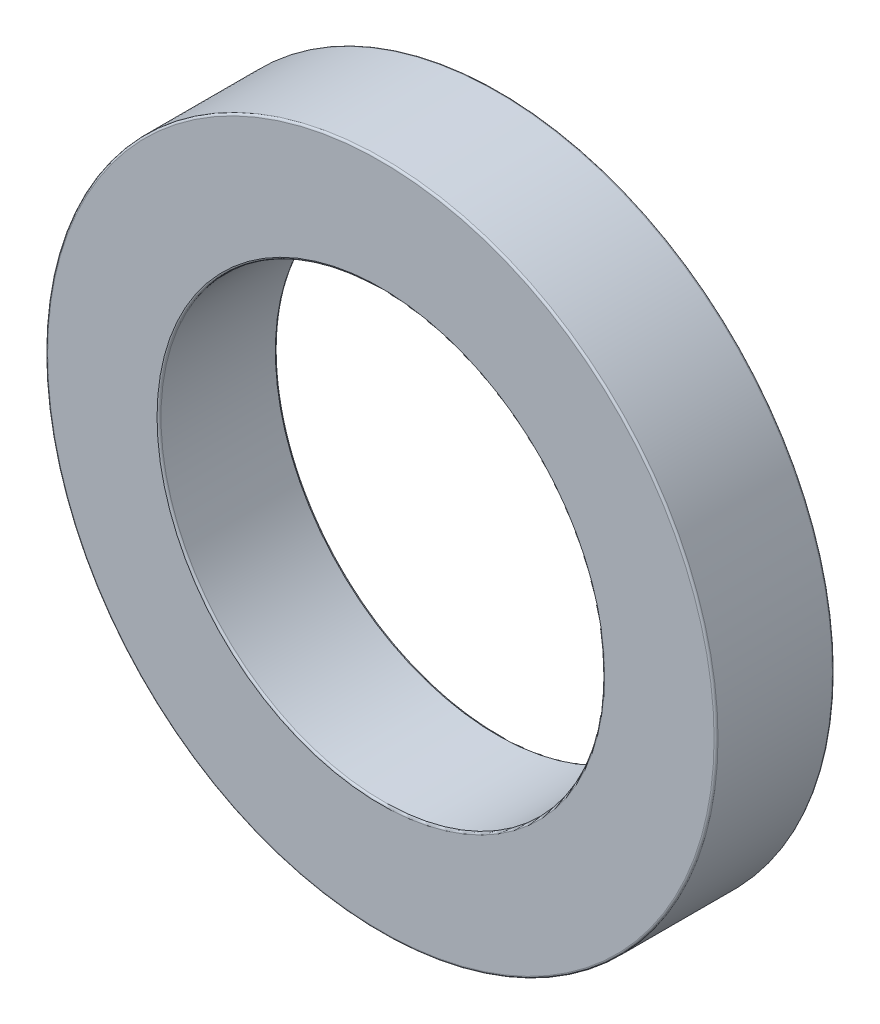
ISO-10303-21;
HEADER;
FILE_DESCRIPTION(('STEP AP214'),'2;1');
FILE_NAME('part.step','',(''),(''),'','','');
FILE_SCHEMA(('AUTOMOTIVE_DESIGN { 1 0 10303 214 1 1 1 1 }'));
ENDSEC;
DATA;
#1=APPLICATION_CONTEXT('core data for automotive mechanical design processes');
#2=APPLICATION_PROTOCOL_DEFINITION('international standard','automotive_design',2000,#1);
#3=PRODUCT_CONTEXT('',#1,'mechanical');
#4=PRODUCT('Part','Part','',(#3));
#5=PRODUCT_RELATED_PRODUCT_CATEGORY('part','',(#4));
#6=PRODUCT_DEFINITION_FORMATION('','',#4);
#7=PRODUCT_DEFINITION_CONTEXT('part definition',#1,'design');
#8=PRODUCT_DEFINITION('design','',#6,#7);
#9=PRODUCT_DEFINITION_SHAPE('','',#8);
#10=(LENGTH_UNIT() NAMED_UNIT(*) SI_UNIT(.MILLI.,.METRE.));
#11=(NAMED_UNIT(*) PLANE_ANGLE_UNIT() SI_UNIT($,.RADIAN.));
#12=(NAMED_UNIT(*) SI_UNIT($,.STERADIAN.) SOLID_ANGLE_UNIT());
#13=UNCERTAINTY_MEASURE_WITH_UNIT(LENGTH_MEASURE(1.E-05),#10,'distance_accuracy_value','');
#14=(GEOMETRIC_REPRESENTATION_CONTEXT(3) GLOBAL_UNCERTAINTY_ASSIGNED_CONTEXT((#13)) GLOBAL_UNIT_ASSIGNED_CONTEXT((#10,
#11,#12)) REPRESENTATION_CONTEXT('',''));
#15=CARTESIAN_POINT('',(0.,0.,0.));
#16=DIRECTION('',(0.,0.,1.));
#17=DIRECTION('',(1.,0.,0.));
#18=AXIS2_PLACEMENT_3D('',#15,#16,#17);
#19=CARTESIAN_POINT('',(0.,0.,12.));
#20=DIRECTION('',(0.,0.,1.));
#21=DIRECTION('',(1.,0.,0.));
#22=AXIS2_PLACEMENT_3D('',#19,#20,#21);
#23=PLANE('',#22);
#24=CARTESIAN_POINT('',(0.,0.,12.));
#25=DIRECTION('',(0.,0.,1.));
#26=DIRECTION('',(1.,0.,0.));
#27=AXIS2_PLACEMENT_3D('',#24,#25,#26);
#28=CIRCLE('',#27,22.7);
#29=CARTESIAN_POINT('',(22.7,0.,12.));
#30=VERTEX_POINT('',#29);
#31=EDGE_CURVE('E47',#30,#30,#28,.F.);
#32=ORIENTED_EDGE('',*,*,#31,.T.);
#33=EDGE_LOOP('',(#32));
#34=FACE_BOUND('',#33,.T.);
#35=CARTESIAN_POINT('',(0.,0.,12.));
#36=DIRECTION('',(0.,0.,1.));
#37=DIRECTION('',(1.,0.,0.));
#38=AXIS2_PLACEMENT_3D('',#35,#36,#37);
#39=CIRCLE('',#38,33.8);
#40=CARTESIAN_POINT('',(33.8,0.,12.));
#41=VERTEX_POINT('',#40);
#42=EDGE_CURVE('E51',#41,#41,#39,.T.);
#43=ORIENTED_EDGE('',*,*,#42,.T.);
#44=EDGE_LOOP('',(#43));
#45=FACE_BOUND('',#44,.T.);
#46=ADVANCED_FACE('F36',(#34,#45),#23,.T.);
#47=CARTESIAN_POINT('',(0.,0.,0.));
#48=DIRECTION('',(0.,0.,1.));
#49=DIRECTION('',(1.,0.,0.));
#50=AXIS2_PLACEMENT_3D('',#47,#48,#49);
#51=PLANE('',#50);
#52=CARTESIAN_POINT('',(0.,0.,0.));
#53=DIRECTION('',(0.,0.,1.));
#54=DIRECTION('',(1.,0.,0.));
#55=AXIS2_PLACEMENT_3D('',#52,#53,#54);
#56=CIRCLE('',#55,22.7);
#57=CARTESIAN_POINT('',(22.7,0.,0.));
#58=VERTEX_POINT('',#57);
#59=EDGE_CURVE('E62',#58,#58,#56,.T.);
#60=ORIENTED_EDGE('',*,*,#59,.T.);
#61=EDGE_LOOP('',(#60));
#62=FACE_BOUND('',#61,.T.);
#63=CARTESIAN_POINT('',(0.,0.,0.));
#64=DIRECTION('',(0.,0.,1.));
#65=DIRECTION('',(1.,0.,0.));
#66=AXIS2_PLACEMENT_3D('',#63,#64,#65);
#67=CIRCLE('',#66,33.8);
#68=CARTESIAN_POINT('',(33.8,0.,0.));
#69=VERTEX_POINT('',#68);
#70=EDGE_CURVE('E65',#69,#69,#67,.F.);
#71=ORIENTED_EDGE('',*,*,#70,.T.);
#72=EDGE_LOOP('',(#71));
#73=FACE_BOUND('',#72,.T.);
#74=ADVANCED_FACE('F69',(#62,#73),#51,.F.);
#75=CARTESIAN_POINT('',(0.,0.,12.));
#76=DIRECTION('',(0.,0.,-1.));
#77=DIRECTION('',(-1.,0.,0.));
#78=AXIS2_PLACEMENT_3D('',#75,#76,#77);
#79=CYLINDRICAL_SURFACE('',#78,34.);
#80=CARTESIAN_POINT('',(0.,0.,0.200000000000001));
#81=DIRECTION('',(0.,0.,1.));
#82=DIRECTION('',(1.,0.,0.));
#83=AXIS2_PLACEMENT_3D('',#80,#81,#82);
#84=CIRCLE('',#83,34.);
#85=CARTESIAN_POINT('',(34.,0.,0.200000000000001));
#86=VERTEX_POINT('',#85);
#87=EDGE_CURVE('E10',#86,#86,#84,.T.);
#88=ORIENTED_EDGE('',*,*,#87,.T.);
#89=EDGE_LOOP('',(#88));
#90=FACE_BOUND('',#89,.T.);
#91=CARTESIAN_POINT('',(0.,0.,11.8));
#92=DIRECTION('',(0.,0.,1.));
#93=DIRECTION('',(1.,0.,0.));
#94=AXIS2_PLACEMENT_3D('',#91,#92,#93);
#95=CIRCLE('',#94,34.);
#96=CARTESIAN_POINT('',(34.,0.,11.8));
#97=VERTEX_POINT('',#96);
#98=EDGE_CURVE('E43',#97,#97,#95,.F.);
#99=ORIENTED_EDGE('',*,*,#98,.T.);
#100=EDGE_LOOP('',(#99));
#101=FACE_BOUND('',#100,.T.);
#102=ADVANCED_FACE('F89',(#90,#101),#79,.T.);
#103=CARTESIAN_POINT('',(0.,0.,12.));
#104=DIRECTION('',(0.,0.,-1.));
#105=DIRECTION('',(-1.,0.,0.));
#106=AXIS2_PLACEMENT_3D('',#103,#104,#105);
#107=CYLINDRICAL_SURFACE('',#106,22.5);
#108=CARTESIAN_POINT('',(0.,0.,0.200000000000001));
#109=DIRECTION('',(0.,0.,1.));
#110=DIRECTION('',(1.,0.,0.));
#111=AXIS2_PLACEMENT_3D('',#108,#109,#110);
#112=CIRCLE('',#111,22.5);
#113=CARTESIAN_POINT('',(22.5,0.,0.200000000000001));
#114=VERTEX_POINT('',#113);
#115=EDGE_CURVE('E56',#114,#114,#112,.F.);
#116=ORIENTED_EDGE('',*,*,#115,.T.);
#117=EDGE_LOOP('',(#116));
#118=FACE_BOUND('',#117,.T.);
#119=CARTESIAN_POINT('',(0.,0.,11.8));
#120=DIRECTION('',(0.,0.,1.));
#121=DIRECTION('',(1.,0.,0.));
#122=AXIS2_PLACEMENT_3D('',#119,#120,#121);
#123=CIRCLE('',#122,22.5);
#124=CARTESIAN_POINT('',(22.5,0.,11.8));
#125=VERTEX_POINT('',#124);
#126=EDGE_CURVE('E59',#125,#125,#123,.T.);
#127=ORIENTED_EDGE('',*,*,#126,.T.);
#128=EDGE_LOOP('',(#127));
#129=FACE_BOUND('',#128,.T.);
#130=ADVANCED_FACE('F94',(#118,#129),#107,.F.);
#131=CARTESIAN_POINT('',(0.,0.,0.200000000000001));
#132=DIRECTION('',(0.,0.,1.));
#133=DIRECTION('',(1.,0.,0.));
#134=AXIS2_PLACEMENT_3D('',#131,#132,#133);
#135=TOROIDAL_SURFACE('',#134,22.7,0.2);
#136=ORIENTED_EDGE('',*,*,#115,.F.);
#137=EDGE_LOOP('',(#136));
#138=FACE_BOUND('',#137,.T.);
#139=ORIENTED_EDGE('',*,*,#59,.F.);
#140=EDGE_LOOP('',(#139));
#141=FACE_BOUND('',#140,.T.);
#142=ADVANCED_FACE('F80',(#138,#141),#135,.T.);
#143=CARTESIAN_POINT('',(0.,0.,11.8));
#144=DIRECTION('',(0.,0.,1.));
#145=DIRECTION('',(1.,0.,0.));
#146=AXIS2_PLACEMENT_3D('',#143,#144,#145);
#147=TOROIDAL_SURFACE('',#146,22.7,0.2);
#148=ORIENTED_EDGE('',*,*,#31,.F.);
#149=EDGE_LOOP('',(#148));
#150=FACE_BOUND('',#149,.T.);
#151=ORIENTED_EDGE('',*,*,#126,.F.);
#152=EDGE_LOOP('',(#151));
#153=FACE_BOUND('',#152,.T.);
#154=ADVANCED_FACE('F74',(#150,#153),#147,.T.);
#155=CARTESIAN_POINT('',(0.,0.,0.200000000000001));
#156=DIRECTION('',(0.,0.,1.));
#157=DIRECTION('',(1.,0.,0.));
#158=AXIS2_PLACEMENT_3D('',#155,#156,#157);
#159=TOROIDAL_SURFACE('',#158,33.8,0.2);
#160=ORIENTED_EDGE('',*,*,#70,.F.);
#161=EDGE_LOOP('',(#160));
#162=FACE_BOUND('',#161,.T.);
#163=ORIENTED_EDGE('',*,*,#87,.F.);
#164=EDGE_LOOP('',(#163));
#165=FACE_BOUND('',#164,.T.);
#166=ADVANCED_FACE('F71',(#162,#165),#159,.T.);
#167=CARTESIAN_POINT('',(0.,0.,11.8));
#168=DIRECTION('',(0.,0.,1.));
#169=DIRECTION('',(1.,0.,0.));
#170=AXIS2_PLACEMENT_3D('',#167,#168,#169);
#171=TOROIDAL_SURFACE('',#170,33.8,0.2);
#172=ORIENTED_EDGE('',*,*,#98,.F.);
#173=EDGE_LOOP('',(#172));
#174=FACE_BOUND('',#173,.T.);
#175=ORIENTED_EDGE('',*,*,#42,.F.);
#176=EDGE_LOOP('',(#175));
#177=FACE_BOUND('',#176,.T.);
#178=ADVANCED_FACE('F38',(#174,#177),#171,.T.);
#179=CLOSED_SHELL('',(#46,#74,#102,#130,#142,#154,#166,#178));
#180=MANIFOLD_SOLID_BREP('B2',#179);
#181=ADVANCED_BREP_SHAPE_REPRESENTATION('',(#18,#180),#14);
#182=SHAPE_DEFINITION_REPRESENTATION(#9,#181);
ENDSEC;
END-ISO-10303-21;
